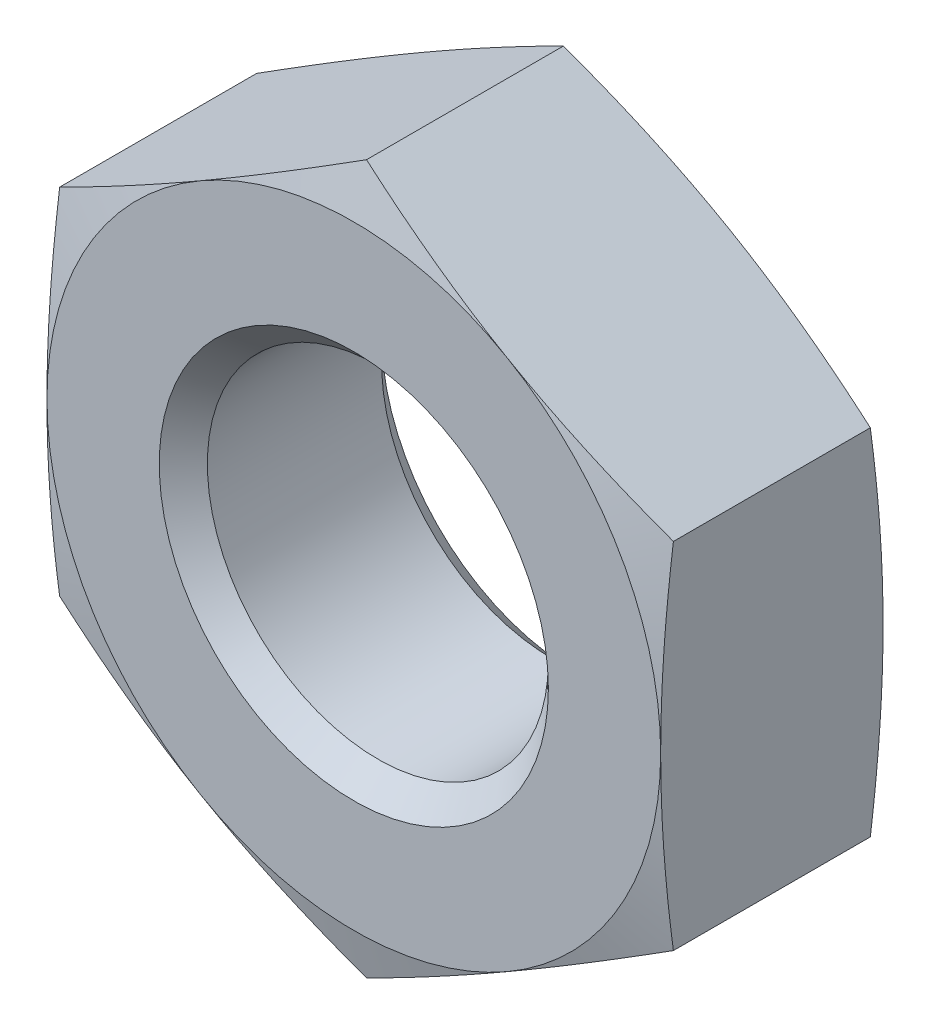
ISO-10303-21;
HEADER;
FILE_DESCRIPTION(('STEP AP214'),'2;1');
FILE_NAME('part.step','',(''),(''),'','','');
FILE_SCHEMA(('AUTOMOTIVE_DESIGN { 1 0 10303 214 1 1 1 1 }'));
ENDSEC;
DATA;
#1=APPLICATION_CONTEXT('core data for automotive mechanical design processes');
#2=APPLICATION_PROTOCOL_DEFINITION('international standard','automotive_design',2000,#1);
#3=PRODUCT_CONTEXT('',#1,'mechanical');
#4=PRODUCT('Part','Part','',(#3));
#5=PRODUCT_RELATED_PRODUCT_CATEGORY('part','',(#4));
#6=PRODUCT_DEFINITION_FORMATION('','',#4);
#7=PRODUCT_DEFINITION_CONTEXT('part definition',#1,'design');
#8=PRODUCT_DEFINITION('design','',#6,#7);
#9=PRODUCT_DEFINITION_SHAPE('','',#8);
#10=(LENGTH_UNIT() NAMED_UNIT(*) SI_UNIT(.MILLI.,.METRE.));
#11=(NAMED_UNIT(*) PLANE_ANGLE_UNIT() SI_UNIT($,.RADIAN.));
#12=(NAMED_UNIT(*) SI_UNIT($,.STERADIAN.) SOLID_ANGLE_UNIT());
#13=UNCERTAINTY_MEASURE_WITH_UNIT(LENGTH_MEASURE(1.E-05),#10,'distance_accuracy_value','');
#14=(GEOMETRIC_REPRESENTATION_CONTEXT(3) GLOBAL_UNCERTAINTY_ASSIGNED_CONTEXT((#13)) GLOBAL_UNIT_ASSIGNED_CONTEXT((#10,
#11,#12)) REPRESENTATION_CONTEXT('',''));
#15=CARTESIAN_POINT('',(0.,0.,0.));
#16=DIRECTION('',(0.,0.,1.));
#17=DIRECTION('',(1.,0.,0.));
#18=AXIS2_PLACEMENT_3D('',#15,#16,#17);
#19=CARTESIAN_POINT('',(0.,0.,0.));
#20=DIRECTION('',(0.,0.,-1.));
#21=DIRECTION('',(-1.,0.,0.));
#22=AXIS2_PLACEMENT_3D('',#19,#20,#21);
#23=PLANE('',#22);
#24=CARTESIAN_POINT('',(0.,0.,0.));
#25=DIRECTION('',(0.,0.,1.));
#26=DIRECTION('',(1.,0.,0.));
#27=AXIS2_PLACEMENT_3D('',#24,#25,#26);
#28=CIRCLE('',#27,8.763);
#29=CARTESIAN_POINT('',(8.763,0.,0.));
#30=VERTEX_POINT('',#29);
#31=CARTESIAN_POINT('',(4.38149999999967,7.58898061336304,0.));
#32=VERTEX_POINT('',#31);
#33=EDGE_CURVE('E11',#30,#32,#28,.T.);
#34=ORIENTED_EDGE('',*,*,#33,.T.);
#35=CARTESIAN_POINT('',(-4.38149999999967,7.58898061336304,0.));
#36=VERTEX_POINT('',#35);
#37=EDGE_CURVE('E47',#32,#36,#28,.T.);
#38=ORIENTED_EDGE('',*,*,#37,.T.);
#39=CARTESIAN_POINT('',(-8.763,0.,0.));
#40=VERTEX_POINT('',#39);
#41=EDGE_CURVE('E332',#36,#40,#28,.T.);
#42=ORIENTED_EDGE('',*,*,#41,.T.);
#43=CARTESIAN_POINT('',(-4.38149999999967,-7.58898061336304,0.));
#44=VERTEX_POINT('',#43);
#45=EDGE_CURVE('E325',#40,#44,#28,.T.);
#46=ORIENTED_EDGE('',*,*,#45,.T.);
#47=CARTESIAN_POINT('',(4.38149999999967,-7.58898061336304,0.));
#48=VERTEX_POINT('',#47);
#49=EDGE_CURVE('E328',#44,#48,#28,.T.);
#50=ORIENTED_EDGE('',*,*,#49,.T.);
#51=EDGE_CURVE('E48',#48,#30,#28,.T.);
#52=ORIENTED_EDGE('',*,*,#51,.T.);
#53=EDGE_LOOP('',(#34,#38,#42,#46,#50,#52));
#54=FACE_BOUND('',#53,.T.);
#55=CARTESIAN_POINT('',(0.,0.,0.));
#56=DIRECTION('',(0.,0.,1.));
#57=DIRECTION('',(1.,0.,0.));
#58=AXIS2_PLACEMENT_3D('',#55,#56,#57);
#59=CIRCLE('',#58,5.55625);
#60=CARTESIAN_POINT('',(5.55625,0.,0.));
#61=VERTEX_POINT('',#60);
#62=EDGE_CURVE('E189',#61,#61,#59,.T.);
#63=ORIENTED_EDGE('',*,*,#62,.F.);
#64=EDGE_LOOP('',(#63));
#65=FACE_BOUND('',#64,.T.);
#66=ADVANCED_FACE('F40',(#54,#65),#23,.F.);
#67=CARTESIAN_POINT('',(0.,8.763,-6.35));
#68=DIRECTION('',(0.,0.,1.));
#69=DIRECTION('',(1.,0.,0.));
#70=AXIS2_PLACEMENT_3D('',#67,#68,#69);
#71=PLANE('',#70);
#72=CARTESIAN_POINT('',(0.,0.,-6.35));
#73=DIRECTION('',(0.,0.,1.));
#74=DIRECTION('',(1.,0.,0.));
#75=AXIS2_PLACEMENT_3D('',#72,#73,#74);
#76=CIRCLE('',#75,8.763);
#77=CARTESIAN_POINT('',(8.763,0.,-6.35));
#78=VERTEX_POINT('',#77);
#79=CARTESIAN_POINT('',(4.38149999999967,7.58898061336304,-6.35));
#80=VERTEX_POINT('',#79);
#81=EDGE_CURVE('E363',#78,#80,#76,.T.);
#82=ORIENTED_EDGE('',*,*,#81,.F.);
#83=CARTESIAN_POINT('',(4.38149999999967,-7.58898061336305,-6.35));
#84=VERTEX_POINT('',#83);
#85=EDGE_CURVE('E366',#84,#78,#76,.T.);
#86=ORIENTED_EDGE('',*,*,#85,.F.);
#87=CARTESIAN_POINT('',(-4.38149999999967,-7.58898061336304,-6.35));
#88=VERTEX_POINT('',#87);
#89=EDGE_CURVE('E367',#88,#84,#76,.T.);
#90=ORIENTED_EDGE('',*,*,#89,.F.);
#91=CARTESIAN_POINT('',(-8.763,0.,-6.35));
#92=VERTEX_POINT('',#91);
#93=EDGE_CURVE('E147',#92,#88,#76,.T.);
#94=ORIENTED_EDGE('',*,*,#93,.F.);
#95=CARTESIAN_POINT('',(-4.38149999999967,7.58898061336304,-6.35));
#96=VERTEX_POINT('',#95);
#97=EDGE_CURVE('E364',#96,#92,#76,.T.);
#98=ORIENTED_EDGE('',*,*,#97,.F.);
#99=EDGE_CURVE('E360',#80,#96,#76,.T.);
#100=ORIENTED_EDGE('',*,*,#99,.F.);
#101=EDGE_LOOP('',(#82,#86,#90,#94,#98,#100));
#102=FACE_BOUND('',#101,.T.);
#103=CARTESIAN_POINT('',(0.,0.,-6.35));
#104=DIRECTION('',(0.,0.,1.));
#105=DIRECTION('',(1.,0.,0.));
#106=AXIS2_PLACEMENT_3D('',#103,#104,#105);
#107=CIRCLE('',#106,5.55625);
#108=CARTESIAN_POINT('',(5.55625,0.,-6.35));
#109=VERTEX_POINT('',#108);
#110=EDGE_CURVE('E209',#109,#109,#107,.T.);
#111=ORIENTED_EDGE('',*,*,#110,.T.);
#112=EDGE_LOOP('',(#111));
#113=FACE_BOUND('',#112,.T.);
#114=ADVANCED_FACE('F213',(#102,#113),#71,.F.);
#115=CARTESIAN_POINT('',(0.,0.,-0.46960775465478));
#116=DIRECTION('',(0.,0.,-1.));
#117=DIRECTION('',(-1.,0.,0.));
#118=AXIS2_PLACEMENT_3D('',#115,#116,#117);
#119=CONICAL_SURFACE('',#118,10.5156,1.30899693899575);
#120=CARTESIAN_POINT('',(-8.7632,5.05920493885486,-0.363273802998116));
#121=CARTESIAN_POINT('',(-8.39927804013863,5.26931538034483,-0.306951649740704));
#122=CARTESIAN_POINT('',(-8.03469625615076,5.47980677147184,-0.255820462401241));
#123=CARTESIAN_POINT('',(-7.30424516280663,5.9015329068439,-0.165987801407446));
#124=CARTESIAN_POINT('',(-6.93837539131905,6.11276791790058,-0.127291376259239));
#125=CARTESIAN_POINT('',(-6.20756655109666,6.5347005985291,-0.064587273673554));
#126=CARTESIAN_POINT('',(-5.84263242389508,6.7453954151054,-0.0405048202732606));
#127=CARTESIAN_POINT('',(-5.11229879530945,7.16705373216752,-0.00821271888191033));
#128=CARTESIAN_POINT('',(-4.74689939765473,7.37801717276519,0.));
#129=CARTESIAN_POINT('',(-4.01610060234528,7.79994405396051,0.));
#130=CARTESIAN_POINT('',(-3.65070120469056,8.01090749455818,-0.00821271888188964));
#131=CARTESIAN_POINT('',(-2.92036757610492,8.4325658116203,-0.0405048202732208));
#132=CARTESIAN_POINT('',(-2.55543344890334,8.64326062819659,-0.0645872736735054));
#133=CARTESIAN_POINT('',(-1.82462460868095,9.06519330882512,-0.127291376259173));
#134=CARTESIAN_POINT('',(-1.45875483719337,9.2764283198818,-0.165987801407371));
#135=CARTESIAN_POINT('',(-0.728303743849241,9.69815445525386,-0.255820462401151));
#136=CARTESIAN_POINT('',(-0.363721959861376,9.90864584638088,-0.306951649740607));
#137=CARTESIAN_POINT('',(0.000200000000000257,10.1187562878708,-0.363273802998012));
#138=B_SPLINE_CURVE_WITH_KNOTS('',3,(#120,#121,#122,#123,#124,#125,#126,#127,#128,#129,#130,
#131,#132,#133,#134,#135,#136,#137),.UNSPECIFIED.,.F.,.F.,(4,2,2,2,2,2,2,2,4),(0.,
1.27200216485818,2.5445201112656,3.81047076613488,5.07617642725257,6.34188208837027,
7.60783274323955,8.88035068964697,10.1523528545052),.UNSPECIFIED.);
#139=CARTESIAN_POINT('',(-8.763,5.0593204089087,-0.363242862360831));
#140=VERTEX_POINT('',#139);
#141=EDGE_CURVE('E340',#140,#36,#138,.T.);
#142=ORIENTED_EDGE('',*,*,#141,.F.);
#143=CARTESIAN_POINT('',(-8.763,-13.3837702899199,-1.93844049434777));
#144=CARTESIAN_POINT('',(-8.763,-12.9862181649756,-1.84934412146664));
#145=CARTESIAN_POINT('',(-8.763,-12.5884173836727,-1.76133740130551));
#146=CARTESIAN_POINT('',(-8.763,-11.792196389762,-1.58809143425452));
#147=CARTESIAN_POINT('',(-8.763,-11.3937761511781,-1.50285230688892));
#148=CARTESIAN_POINT('',(-8.763,-10.5958372220428,-1.33565551527808));
#149=CARTESIAN_POINT('',(-8.763,-10.1963178373504,-1.2537011520015));
#150=CARTESIAN_POINT('',(-8.763,-9.39644750668763,-1.09395849709296));
#151=CARTESIAN_POINT('',(-8.763,-8.99609656776501,-1.0161701703002));
#152=CARTESIAN_POINT('',(-8.763,-8.19761138133054,-0.866351145193688));
#153=CARTESIAN_POINT('',(-8.763,-7.7994848436043,-0.794279558247119));
#154=CARTESIAN_POINT('',(-8.763,-7.00214580050872,-0.656428589692995));
#155=CARTESIAN_POINT('',(-8.763,-6.60293331923369,-0.590649069632863));
#156=CARTESIAN_POINT('',(-8.763,-5.80334489207022,-0.466863323728334));
#157=CARTESIAN_POINT('',(-8.763,-5.40296909562369,-0.408856140943656));
#158=CARTESIAN_POINT('',(-8.763,-4.60094342795015,-0.302324446329907));
#159=CARTESIAN_POINT('',(-8.763,-4.19929355552988,-0.253799943384739));
#160=CARTESIAN_POINT('',(-8.763,-3.39018837962683,-0.167607648360078));
#161=CARTESIAN_POINT('',(-8.763,-2.98271903379171,-0.130069718559839));
#162=CARTESIAN_POINT('',(-8.763,-2.16675595793937,-0.0684401455251191));
#163=CARTESIAN_POINT('',(-8.763,-1.75826225163068,-0.0443481939203276));
#164=CARTESIAN_POINT('',(-8.763,-0.940843012454314,-0.0110157171231371));
#165=CARTESIAN_POINT('',(-8.763,-0.531917760453649,-0.00176844288722009));
#166=CARTESIAN_POINT('',(-8.763,0.285991550994262,0.00130613861734006));
#167=CARTESIAN_POINT('',(-8.763,0.694975610390509,-0.00486654082138649));
#168=CARTESIAN_POINT('',(-8.763,1.51391612064036,-0.0322847373045139));
#169=CARTESIAN_POINT('',(-8.763,1.92387070253099,-0.0535849596048437));
#170=CARTESIAN_POINT('',(-8.763,2.74281574927551,-0.110042389929746));
#171=CARTESIAN_POINT('',(-8.763,3.15180619258268,-0.145199904740592));
#172=CARTESIAN_POINT('',(-8.763,3.96881951949812,-0.22759601433524));
#173=CARTESIAN_POINT('',(-8.763,4.37684159561712,-0.27484249329322));
#174=CARTESIAN_POINT('',(-8.763,5.19157263502939,-0.379450538965934));
#175=CARTESIAN_POINT('',(-8.763,5.59828159419586,-0.436812137438485));
#176=CARTESIAN_POINT('',(-8.763,6.38354017699799,-0.555743213369239));
#177=CARTESIAN_POINT('',(-8.763,6.76217092727843,-0.616782449788006));
#178=CARTESIAN_POINT('',(-8.763,7.51843456139871,-0.744785447310177));
#179=CARTESIAN_POINT('',(-8.763,7.89606741772422,-0.81174937005183));
#180=CARTESIAN_POINT('',(-8.763,8.65047296826483,-0.950519483254617));
#181=CARTESIAN_POINT('',(-8.763,9.02724558226135,-1.02232610765112));
#182=CARTESIAN_POINT('',(-8.763,9.78001835031701,-1.16989133180626));
#183=CARTESIAN_POINT('',(-8.763,10.1560184943023,-1.24564998276803));
#184=CARTESIAN_POINT('',(-8.763,10.9074351141636,-1.40042140295396));
#185=CARTESIAN_POINT('',(-8.763,11.2828514390693,-1.47943490312786));
#186=CARTESIAN_POINT('',(-8.763,12.0331126862545,-1.64013356208892));
#187=CARTESIAN_POINT('',(-8.763,12.4079576051979,-1.72181873641227));
#188=CARTESIAN_POINT('',(-8.763,13.5317125358089,-1.97016081007156));
#189=CARTESIAN_POINT('',(-8.763,14.279893613434,-2.14011488200832));
#190=CARTESIAN_POINT('',(-8.763,15.7674818810842,-2.48445565533592));
#191=CARTESIAN_POINT('',(-8.763,16.5069030435853,-2.65878238911854));
#192=CARTESIAN_POINT('',(-8.763,17.9847143075208,-3.01180428588832));
#193=CARTESIAN_POINT('',(-8.763,18.7231043899121,-3.19049952845809));
#194=CARTESIAN_POINT('',(-8.763,20.1981842908095,-3.5508912153922));
#195=CARTESIAN_POINT('',(-8.763,20.9348750830499,-3.73258368406784));
#196=CARTESIAN_POINT('',(-8.763,22.4076149635126,-4.09844959544106));
#197=CARTESIAN_POINT('',(-8.763,23.1436640721096,-4.2826229560661));
#198=CARTESIAN_POINT('',(-8.763,23.8794895947639,-4.46767540457424));
#199=B_SPLINE_CURVE_WITH_KNOTS('',3,(#143,#144,#145,#146,#147,#148,#149,#150,#151,#152,#153,
#154,#155,#156,#157,#158,#159,#160,#161,#162,#163,#164,#165,#166,#167,#168,#169,#170,#171,#172,
#173,#174,#175,#176,#177,#178,#179,#180,#181,#182,#183,#184,#185,#186,#187,#188,#189,#190,#191,
#192,#193,#194,#195,#196,#197,#198),.UNSPECIFIED.,.F.,.F.,(4,2,2,2,2,2,2,2,2,2,2,2,2,2,2,2,2,2,
2,2,2,2,2,2,2,2,2,4),(0.,1.22224582683769,2.44454436889226,3.66804192292283,4.89152914916844,
6.10528101679588,7.31900617050677,8.53258175121245,9.74615846885785,10.9735486088279,
12.2009105986532,13.4277144175138,14.6545171788198,15.8857791275233,17.1170683366373,
18.3491626232361,19.5812607782343,20.7317631716272,21.8822969628969,23.0329339862866,
24.183585921232,25.3344976849745,26.4854161426325,28.7870971026554,31.0661607154404,
33.345265877679,35.6215585602892,37.8977761229223),.UNSPECIFIED.);
#200=EDGE_CURVE('E158',#40,#140,#199,.T.);
#201=ORIENTED_EDGE('',*,*,#200,.F.);
#202=ORIENTED_EDGE('',*,*,#41,.F.);
#203=EDGE_LOOP('',(#142,#201,#202));
#204=FACE_BOUND('',#203,.T.);
#205=ADVANCED_FACE('F231',(#204),#119,.T.);
#206=CARTESIAN_POINT('',(0.,10.118640817817,-0.363242862360728));
#207=VERTEX_POINT('',#206);
#208=EDGE_CURVE('E337',#36,#207,#138,.T.);
#209=ORIENTED_EDGE('',*,*,#208,.F.);
#210=ORIENTED_EDGE('',*,*,#37,.F.);
#211=CARTESIAN_POINT('',(-0.0002,10.1187562878708,-0.363273802998012));
#212=CARTESIAN_POINT('',(0.363721959861376,9.90864584638087,-0.306951649740606));
#213=CARTESIAN_POINT('',(0.728303743849241,9.69815445525386,-0.25582046240115));
#214=CARTESIAN_POINT('',(1.45875483719337,9.2764283198818,-0.165987801407371));
#215=CARTESIAN_POINT('',(1.82462460868095,9.06519330882512,-0.127291376259173));
#216=CARTESIAN_POINT('',(2.55543344890334,8.64326062819659,-0.0645872736735056));
#217=CARTESIAN_POINT('',(2.92036757610492,8.4325658116203,-0.0405048202732212));
#218=CARTESIAN_POINT('',(3.65070120469056,8.01090749455818,-0.00821271888188998));
#219=CARTESIAN_POINT('',(4.01610060234528,7.79994405396051,0.));
#220=CARTESIAN_POINT('',(4.74689939765473,7.37801717276518,0.));
#221=CARTESIAN_POINT('',(5.11229879530945,7.16705373216752,-0.00821271888190999));
#222=CARTESIAN_POINT('',(5.84263242389508,6.7453954151054,-0.0405048202732604));
#223=CARTESIAN_POINT('',(6.20756655109666,6.5347005985291,-0.064587273673554));
#224=CARTESIAN_POINT('',(6.93837539131905,6.11276791790058,-0.127291376259239));
#225=CARTESIAN_POINT('',(7.30424516280663,5.9015329068439,-0.165987801407446));
#226=CARTESIAN_POINT('',(8.03469625615076,5.47980677147184,-0.255820462401241));
#227=CARTESIAN_POINT('',(8.39927804013863,5.26931538034483,-0.306951649740704));
#228=CARTESIAN_POINT('',(8.7632,5.05920493885486,-0.363273802998116));
#229=B_SPLINE_CURVE_WITH_KNOTS('',3,(#211,#212,#213,#214,#215,#216,#217,#218,#219,#220,#221,
#222,#223,#224,#225,#226,#227,#228),.UNSPECIFIED.,.F.,.F.,(4,2,2,2,2,2,2,2,4),(0.,
1.27200216485818,2.5445201112656,3.81047076613488,5.07617642725258,6.34188208837027,
7.60783274323955,8.88035068964697,10.1523528545052),.UNSPECIFIED.);
#230=EDGE_CURVE('E270',#207,#32,#229,.T.);
#231=ORIENTED_EDGE('',*,*,#230,.F.);
#232=EDGE_LOOP('',(#209,#210,#231));
#233=FACE_BOUND('',#232,.T.);
#234=ADVANCED_FACE('F279',(#233),#119,.T.);
#235=CARTESIAN_POINT('',(8.763,5.0593204089087,-0.363242862360831));
#236=VERTEX_POINT('',#235);
#237=EDGE_CURVE('E265',#32,#236,#229,.T.);
#238=ORIENTED_EDGE('',*,*,#237,.F.);
#239=ORIENTED_EDGE('',*,*,#33,.F.);
#240=CARTESIAN_POINT('',(8.763,-13.3837702899199,-1.93844049434777));
#241=CARTESIAN_POINT('',(8.763,-12.9862181649756,-1.84934412146664));
#242=CARTESIAN_POINT('',(8.763,-12.5884173836727,-1.76133740130551));
#243=CARTESIAN_POINT('',(8.763,-11.792196389762,-1.58809143425452));
#244=CARTESIAN_POINT('',(8.763,-11.3937761511781,-1.50285230688892));
#245=CARTESIAN_POINT('',(8.763,-10.5958372220428,-1.33565551527808));
#246=CARTESIAN_POINT('',(8.763,-10.1963178373504,-1.2537011520015));
#247=CARTESIAN_POINT('',(8.763,-9.39644750668763,-1.09395849709296));
#248=CARTESIAN_POINT('',(8.763,-8.99609656776501,-1.0161701703002));
#249=CARTESIAN_POINT('',(8.763,-8.19761138133054,-0.866351145193688));
#250=CARTESIAN_POINT('',(8.763,-7.7994848436043,-0.794279558247119));
#251=CARTESIAN_POINT('',(8.763,-7.00214580050872,-0.656428589692995));
#252=CARTESIAN_POINT('',(8.763,-6.60293331923369,-0.590649069632863));
#253=CARTESIAN_POINT('',(8.763,-5.80334489207022,-0.466863323728334));
#254=CARTESIAN_POINT('',(8.763,-5.40296909562369,-0.408856140943656));
#255=CARTESIAN_POINT('',(8.763,-4.60094342795015,-0.302324446329907));
#256=CARTESIAN_POINT('',(8.763,-4.19929355552988,-0.253799943384739));
#257=CARTESIAN_POINT('',(8.763,-3.39018837962683,-0.167607648360078));
#258=CARTESIAN_POINT('',(8.763,-2.98271903379171,-0.130069718559839));
#259=CARTESIAN_POINT('',(8.763,-2.16675595793937,-0.0684401455251191));
#260=CARTESIAN_POINT('',(8.763,-1.75826225163068,-0.0443481939203276));
#261=CARTESIAN_POINT('',(8.763,-0.940843012454314,-0.0110157171231371));
#262=CARTESIAN_POINT('',(8.763,-0.531917760453649,-0.00176844288722009));
#263=CARTESIAN_POINT('',(8.763,0.285991550994262,0.00130613861734006));
#264=CARTESIAN_POINT('',(8.763,0.694975610390509,-0.00486654082138649));
#265=CARTESIAN_POINT('',(8.763,1.51391612064036,-0.0322847373045139));
#266=CARTESIAN_POINT('',(8.763,1.92387070253099,-0.0535849596048437));
#267=CARTESIAN_POINT('',(8.763,2.74281574927551,-0.110042389929746));
#268=CARTESIAN_POINT('',(8.763,3.15180619258268,-0.145199904740592));
#269=CARTESIAN_POINT('',(8.763,3.96881951949812,-0.22759601433524));
#270=CARTESIAN_POINT('',(8.763,4.37684159561712,-0.27484249329322));
#271=CARTESIAN_POINT('',(8.763,5.19157263502939,-0.379450538965934));
#272=CARTESIAN_POINT('',(8.763,5.59828159419586,-0.436812137438485));
#273=CARTESIAN_POINT('',(8.763,6.38354017699799,-0.555743213369239));
#274=CARTESIAN_POINT('',(8.763,6.76217092727843,-0.616782449788006));
#275=CARTESIAN_POINT('',(8.763,7.51843456139871,-0.744785447310177));
#276=CARTESIAN_POINT('',(8.763,7.89606741772422,-0.81174937005183));
#277=CARTESIAN_POINT('',(8.763,8.65047296826483,-0.950519483254617));
#278=CARTESIAN_POINT('',(8.763,9.02724558226135,-1.02232610765112));
#279=CARTESIAN_POINT('',(8.763,9.78001835031701,-1.16989133180626));
#280=CARTESIAN_POINT('',(8.763,10.1560184943023,-1.24564998276803));
#281=CARTESIAN_POINT('',(8.763,10.9074351141636,-1.40042140295396));
#282=CARTESIAN_POINT('',(8.763,11.2828514390693,-1.47943490312786));
#283=CARTESIAN_POINT('',(8.763,12.0331126862545,-1.64013356208892));
#284=CARTESIAN_POINT('',(8.763,12.4079576051979,-1.72181873641227));
#285=CARTESIAN_POINT('',(8.763,13.5317125358089,-1.97016081007156));
#286=CARTESIAN_POINT('',(8.763,14.279893613434,-2.14011488200832));
#287=CARTESIAN_POINT('',(8.763,15.7674818810842,-2.48445565533592));
#288=CARTESIAN_POINT('',(8.763,16.5069030435853,-2.65878238911854));
#289=CARTESIAN_POINT('',(8.763,17.9847143075208,-3.01180428588832));
#290=CARTESIAN_POINT('',(8.763,18.7231043899121,-3.19049952845809));
#291=CARTESIAN_POINT('',(8.763,20.1981842908095,-3.5508912153922));
#292=CARTESIAN_POINT('',(8.763,20.9348750830499,-3.73258368406784));
#293=CARTESIAN_POINT('',(8.763,22.4076149635126,-4.09844959544106));
#294=CARTESIAN_POINT('',(8.763,23.1436640721096,-4.2826229560661));
#295=CARTESIAN_POINT('',(8.763,23.8794895947639,-4.46767540457424));
#296=B_SPLINE_CURVE_WITH_KNOTS('',3,(#240,#241,#242,#243,#244,#245,#246,#247,#248,#249,#250,
#251,#252,#253,#254,#255,#256,#257,#258,#259,#260,#261,#262,#263,#264,#265,#266,#267,#268,#269,
#270,#271,#272,#273,#274,#275,#276,#277,#278,#279,#280,#281,#282,#283,#284,#285,#286,#287,#288,
#289,#290,#291,#292,#293,#294,#295),.UNSPECIFIED.,.F.,.F.,(4,2,2,2,2,2,2,2,2,2,2,2,2,2,2,2,2,2,
2,2,2,2,2,2,2,2,2,4),(0.,1.22224582683769,2.44454436889226,3.66804192292283,4.89152914916844,
6.10528101679588,7.31900617050677,8.53258175121245,9.74615846885785,10.9735486088279,
12.2009105986532,13.4277144175138,14.6545171788198,15.8857791275233,17.1170683366373,
18.3491626232361,19.5812607782343,20.7317631716272,21.8822969628969,23.0329339862866,
24.183585921232,25.3344976849745,26.4854161426325,28.7870971026554,31.0661607154404,
33.345265877679,35.6215585602892,37.8977761229223),.UNSPECIFIED.);
#297=EDGE_CURVE('E297',#236,#30,#296,.F.);
#298=ORIENTED_EDGE('',*,*,#297,.F.);
#299=EDGE_LOOP('',(#238,#239,#298));
#300=FACE_BOUND('',#299,.T.);
#301=ADVANCED_FACE('F351',(#300),#119,.T.);
#302=CARTESIAN_POINT('',(8.763,-5.0593204089087,-0.363242862360831));
#303=VERTEX_POINT('',#302);
#304=EDGE_CURVE('E293',#30,#303,#296,.F.);
#305=ORIENTED_EDGE('',*,*,#304,.F.);
#306=ORIENTED_EDGE('',*,*,#51,.F.);
#307=CARTESIAN_POINT('',(8.7632,-5.05920493885486,-0.363273802998116));
#308=CARTESIAN_POINT('',(8.39927804013863,-5.26931538034483,-0.306951649740704));
#309=CARTESIAN_POINT('',(8.03469625615076,-5.47980677147184,-0.255820462401241));
#310=CARTESIAN_POINT('',(7.30424516280663,-5.9015329068439,-0.165987801407446));
#311=CARTESIAN_POINT('',(6.93837539131905,-6.11276791790058,-0.127291376259239));
#312=CARTESIAN_POINT('',(6.20756655109666,-6.5347005985291,-0.064587273673554));
#313=CARTESIAN_POINT('',(5.84263242389508,-6.7453954151054,-0.0405048202732606));
#314=CARTESIAN_POINT('',(5.11229879530945,-7.16705373216752,-0.00821271888191033));
#315=CARTESIAN_POINT('',(4.74689939765473,-7.37801717276519,0.));
#316=CARTESIAN_POINT('',(4.01610060234528,-7.79994405396051,0.));
#317=CARTESIAN_POINT('',(3.65070120469056,-8.01090749455818,-0.00821271888188964));
#318=CARTESIAN_POINT('',(2.92036757610492,-8.4325658116203,-0.0405048202732208));
#319=CARTESIAN_POINT('',(2.55543344890334,-8.64326062819659,-0.0645872736735054));
#320=CARTESIAN_POINT('',(1.82462460868095,-9.06519330882512,-0.127291376259173));
#321=CARTESIAN_POINT('',(1.45875483719337,-9.2764283198818,-0.165987801407371));
#322=CARTESIAN_POINT('',(0.728303743849241,-9.69815445525386,-0.255820462401151));
#323=CARTESIAN_POINT('',(0.363721959861376,-9.90864584638088,-0.306951649740607));
#324=CARTESIAN_POINT('',(-0.000200000000000257,-10.1187562878708,-0.363273802998012));
#325=B_SPLINE_CURVE_WITH_KNOTS('',3,(#307,#308,#309,#310,#311,#312,#313,#314,#315,#316,#317,
#318,#319,#320,#321,#322,#323,#324),.UNSPECIFIED.,.F.,.F.,(4,2,2,2,2,2,2,2,4),(0.,
1.27200216485818,2.5445201112656,3.81047076613488,5.07617642725257,6.34188208837027,
7.60783274323955,8.88035068964697,10.1523528545052),.UNSPECIFIED.);
#326=EDGE_CURVE('E303',#303,#48,#325,.T.);
#327=ORIENTED_EDGE('',*,*,#326,.F.);
#328=EDGE_LOOP('',(#305,#306,#327));
#329=FACE_BOUND('',#328,.T.);
#330=ADVANCED_FACE('F391',(#329),#119,.T.);
#331=CARTESIAN_POINT('',(0.,-10.118640817817,-0.363242862360728));
#332=VERTEX_POINT('',#331);
#333=EDGE_CURVE('E288',#48,#332,#325,.T.);
#334=ORIENTED_EDGE('',*,*,#333,.F.);
#335=ORIENTED_EDGE('',*,*,#49,.F.);
#336=CARTESIAN_POINT('',(0.0002,-10.1187562878708,-0.363273802998012));
#337=CARTESIAN_POINT('',(-0.363721959861376,-9.90864584638087,-0.306951649740606));
#338=CARTESIAN_POINT('',(-0.728303743849241,-9.69815445525386,-0.25582046240115));
#339=CARTESIAN_POINT('',(-1.45875483719337,-9.2764283198818,-0.165987801407371));
#340=CARTESIAN_POINT('',(-1.82462460868095,-9.06519330882512,-0.127291376259173));
#341=CARTESIAN_POINT('',(-2.55543344890334,-8.64326062819659,-0.0645872736735056));
#342=CARTESIAN_POINT('',(-2.92036757610492,-8.4325658116203,-0.0405048202732212));
#343=CARTESIAN_POINT('',(-3.65070120469056,-8.01090749455818,-0.00821271888188998));
#344=CARTESIAN_POINT('',(-4.01610060234528,-7.79994405396051,0.));
#345=CARTESIAN_POINT('',(-4.74689939765473,-7.37801717276518,0.));
#346=CARTESIAN_POINT('',(-5.11229879530945,-7.16705373216752,-0.00821271888190999));
#347=CARTESIAN_POINT('',(-5.84263242389508,-6.7453954151054,-0.0405048202732604));
#348=CARTESIAN_POINT('',(-6.20756655109666,-6.5347005985291,-0.064587273673554));
#349=CARTESIAN_POINT('',(-6.93837539131905,-6.11276791790058,-0.127291376259239));
#350=CARTESIAN_POINT('',(-7.30424516280663,-5.9015329068439,-0.165987801407446));
#351=CARTESIAN_POINT('',(-8.03469625615076,-5.47980677147184,-0.255820462401241));
#352=CARTESIAN_POINT('',(-8.39927804013863,-5.26931538034483,-0.306951649740704));
#353=CARTESIAN_POINT('',(-8.7632,-5.05920493885486,-0.363273802998116));
#354=B_SPLINE_CURVE_WITH_KNOTS('',3,(#336,#337,#338,#339,#340,#341,#342,#343,#344,#345,#346,
#347,#348,#349,#350,#351,#352,#353),.UNSPECIFIED.,.F.,.F.,(4,2,2,2,2,2,2,2,4),(0.,
1.27200216485818,2.5445201112656,3.81047076613488,5.07617642725258,6.34188208837027,
7.60783274323955,8.88035068964697,10.1523528545052),.UNSPECIFIED.);
#355=EDGE_CURVE('E150',#332,#44,#354,.T.);
#356=ORIENTED_EDGE('',*,*,#355,.F.);
#357=EDGE_LOOP('',(#334,#335,#356));
#358=FACE_BOUND('',#357,.T.);
#359=ADVANCED_FACE('F329',(#358),#119,.T.);
#360=CARTESIAN_POINT('',(-8.763,-5.0593204089087,-0.363242862360831));
#361=VERTEX_POINT('',#360);
#362=EDGE_CURVE('E142',#44,#361,#354,.T.);
#363=ORIENTED_EDGE('',*,*,#362,.F.);
#364=ORIENTED_EDGE('',*,*,#45,.F.);
#365=EDGE_CURVE('E55',#361,#40,#199,.T.);
#366=ORIENTED_EDGE('',*,*,#365,.F.);
#367=EDGE_LOOP('',(#363,#364,#366));
#368=FACE_BOUND('',#367,.T.);
#369=ADVANCED_FACE('F281',(#368),#119,.T.);
#370=CARTESIAN_POINT('',(0.,10.118640817817,-6.35));
#371=DIRECTION('',(-0.499999999999971,0.866025403784455,0.));
#372=DIRECTION('',(-0.866025403784455,-0.499999999999971,0.));
#373=AXIS2_PLACEMENT_3D('',#370,#371,#372);
#374=PLANE('',#373);
#375=ORIENTED_EDGE('',*,*,#141,.T.);
#376=ORIENTED_EDGE('',*,*,#208,.T.);
#377=DIRECTION('',(0.,0.,1.));
#378=VECTOR('',#377,1.);
#379=CARTESIAN_POINT('',(0.,10.118640817817,-6.35));
#380=LINE('',#379,#378);
#381=CARTESIAN_POINT('',(0.,10.118640817817,-5.98675713763926));
#382=VERTEX_POINT('',#381);
#383=EDGE_CURVE('E135',#382,#207,#380,.T.);
#384=ORIENTED_EDGE('',*,*,#383,.F.);
#385=CARTESIAN_POINT('',(0.000200000000000106,10.1187562878708,-5.98672619700197));
#386=CARTESIAN_POINT('',(-0.363721959861376,9.90864584638088,-6.04304835025938));
#387=CARTESIAN_POINT('',(-0.728303743849241,9.69815445525386,-6.09417953759884));
#388=CARTESIAN_POINT('',(-1.45875483719337,9.2764283198818,-6.18401219859262));
#389=CARTESIAN_POINT('',(-1.82462460868095,9.06519330882512,-6.22270862374082));
#390=CARTESIAN_POINT('',(-2.55543344890334,8.64326062819659,-6.28541272632649));
#391=CARTESIAN_POINT('',(-2.92036757610492,8.4325658116203,-6.30949517972678));
#392=CARTESIAN_POINT('',(-3.65070120469056,8.01090749455818,-6.34178728111811));
#393=CARTESIAN_POINT('',(-4.01610060234528,7.79994405396051,-6.35000000000005));
#394=CARTESIAN_POINT('',(-4.74689939765473,7.37801717276519,-6.35000000000004));
#395=CARTESIAN_POINT('',(-5.11229879530945,7.16705373216752,-6.34178728111809));
#396=CARTESIAN_POINT('',(-5.84263242389508,6.7453954151054,-6.30949517972674));
#397=CARTESIAN_POINT('',(-6.20756655109666,6.5347005985291,-6.28541272632644));
#398=CARTESIAN_POINT('',(-6.93837539131905,6.11276791790058,-6.22270862374075));
#399=CARTESIAN_POINT('',(-7.30424516280663,5.9015329068439,-6.18401219859255));
#400=CARTESIAN_POINT('',(-8.03469625615076,5.47980677147184,-6.09417953759875));
#401=CARTESIAN_POINT('',(-8.39927804013863,5.26931538034483,-6.04304835025928));
#402=CARTESIAN_POINT('',(-8.7632,5.05920493885486,-5.98672619700187));
#403=B_SPLINE_CURVE_WITH_KNOTS('',3,(#385,#386,#387,#388,#389,#390,#391,#392,#393,#394,#395,
#396,#397,#398,#399,#400,#401,#402),.UNSPECIFIED.,.F.,.F.,(4,2,2,2,2,2,2,2,4),(0.,
1.27200216485818,2.5445201112656,3.81047076613488,5.07617642725258,6.34188208837027,
7.60783274323955,8.88035068964697,10.1523528545052),.UNSPECIFIED.);
#404=EDGE_CURVE('E341',#382,#96,#403,.T.);
#405=ORIENTED_EDGE('',*,*,#404,.T.);
#406=CARTESIAN_POINT('',(-8.763,5.0593204089087,-5.98675713763915));
#407=VERTEX_POINT('',#406);
#408=EDGE_CURVE('E272',#96,#407,#403,.T.);
#409=ORIENTED_EDGE('',*,*,#408,.T.);
#410=DIRECTION('',(0.,0.,1.));
#411=VECTOR('',#410,1.);
#412=CARTESIAN_POINT('',(-8.763,5.0593204089087,-6.35));
#413=LINE('',#412,#411);
#414=EDGE_CURVE('E144',#407,#140,#413,.T.);
#415=ORIENTED_EDGE('',*,*,#414,.T.);
#416=EDGE_LOOP('',(#375,#376,#384,#405,#409,#415));
#417=FACE_BOUND('',#416,.T.);
#418=ADVANCED_FACE('F181',(#417),#374,.T.);
#419=CARTESIAN_POINT('',(8.763,5.0593204089087,-6.35));
#420=DIRECTION('',(0.499999999999971,0.866025403784455,0.));
#421=DIRECTION('',(-0.866025403784455,0.499999999999971,0.));
#422=AXIS2_PLACEMENT_3D('',#419,#420,#421);
#423=PLANE('',#422);
#424=ORIENTED_EDGE('',*,*,#230,.T.);
#425=ORIENTED_EDGE('',*,*,#237,.T.);
#426=DIRECTION('',(0.,0.,1.));
#427=VECTOR('',#426,1.);
#428=CARTESIAN_POINT('',(8.763,5.0593204089087,-6.35));
#429=LINE('',#428,#427);
#430=CARTESIAN_POINT('',(8.763,5.0593204089087,-5.98675713763915));
#431=VERTEX_POINT('',#430);
#432=EDGE_CURVE('E196',#431,#236,#429,.T.);
#433=ORIENTED_EDGE('',*,*,#432,.F.);
#434=CARTESIAN_POINT('',(8.7632,5.05920493885486,-5.98672619700187));
#435=CARTESIAN_POINT('',(8.39927804013863,5.26931538034483,-6.04304835025928));
#436=CARTESIAN_POINT('',(8.03469625615076,5.47980677147184,-6.09417953759875));
#437=CARTESIAN_POINT('',(7.30424516280663,5.9015329068439,-6.18401219859255));
#438=CARTESIAN_POINT('',(6.93837539131905,6.11276791790058,-6.22270862374075));
#439=CARTESIAN_POINT('',(6.20756655109666,6.5347005985291,-6.28541272632644));
#440=CARTESIAN_POINT('',(5.84263242389508,6.7453954151054,-6.30949517972674));
#441=CARTESIAN_POINT('',(5.11229879530945,7.16705373216752,-6.34178728111809));
#442=CARTESIAN_POINT('',(4.74689939765473,7.37801717276518,-6.35000000000004));
#443=CARTESIAN_POINT('',(4.01610060234528,7.79994405396051,-6.35000000000005));
#444=CARTESIAN_POINT('',(3.65070120469056,8.01090749455818,-6.34178728111811));
#445=CARTESIAN_POINT('',(2.92036757610492,8.4325658116203,-6.30949517972678));
#446=CARTESIAN_POINT('',(2.55543344890334,8.64326062819659,-6.28541272632649));
#447=CARTESIAN_POINT('',(1.82462460868095,9.06519330882512,-6.22270862374082));
#448=CARTESIAN_POINT('',(1.45875483719337,9.2764283198818,-6.18401219859262));
#449=CARTESIAN_POINT('',(0.728303743849241,9.69815445525386,-6.09417953759884));
#450=CARTESIAN_POINT('',(0.363721959861375,9.90864584638088,-6.04304835025938));
#451=CARTESIAN_POINT('',(-0.000200000000000574,10.1187562878708,-5.98672619700197));
#452=B_SPLINE_CURVE_WITH_KNOTS('',3,(#434,#435,#436,#437,#438,#439,#440,#441,#442,#443,#444,
#445,#446,#447,#448,#449,#450,#451),.UNSPECIFIED.,.F.,.F.,(4,2,2,2,2,2,2,2,4),(0.,
1.27200216485818,2.5445201112656,3.81047076613488,5.07617642725258,6.34188208837027,
7.60783274323956,8.88035068964697,10.1523528545052),.UNSPECIFIED.);
#453=EDGE_CURVE('E271',#431,#80,#452,.T.);
#454=ORIENTED_EDGE('',*,*,#453,.T.);
#455=EDGE_CURVE('E259',#80,#382,#452,.T.);
#456=ORIENTED_EDGE('',*,*,#455,.T.);
#457=ORIENTED_EDGE('',*,*,#383,.T.);
#458=EDGE_LOOP('',(#424,#425,#433,#454,#456,#457));
#459=FACE_BOUND('',#458,.T.);
#460=ADVANCED_FACE('F251',(#459),#423,.T.);
#461=CARTESIAN_POINT('',(8.763,-5.0593204089087,-6.35));
#462=DIRECTION('',(1.,0.,0.));
#463=DIRECTION('',(0.,0.,-1.));
#464=AXIS2_PLACEMENT_3D('',#461,#462,#463);
#465=PLANE('',#464);
#466=ORIENTED_EDGE('',*,*,#297,.T.);
#467=ORIENTED_EDGE('',*,*,#304,.T.);
#468=DIRECTION('',(0.,0.,1.));
#469=VECTOR('',#468,1.);
#470=CARTESIAN_POINT('',(8.763,-5.0593204089087,-6.35));
#471=LINE('',#470,#469);
#472=CARTESIAN_POINT('',(8.763,-5.0593204089087,-5.98675713763915));
#473=VERTEX_POINT('',#472);
#474=EDGE_CURVE('E193',#473,#303,#471,.T.);
#475=ORIENTED_EDGE('',*,*,#474,.F.);
#476=CARTESIAN_POINT('',(8.763,-13.3837702899199,-4.41155950565215));
#477=CARTESIAN_POINT('',(8.763,-12.9862181649756,-4.50065587853328));
#478=CARTESIAN_POINT('',(8.763,-12.5884173836727,-4.58866259869441));
#479=CARTESIAN_POINT('',(8.763,-11.792196389762,-4.76190856574541));
#480=CARTESIAN_POINT('',(8.763,-11.3937761511781,-4.84714769311101));
#481=CARTESIAN_POINT('',(8.763,-10.5958372220428,-5.01434448472186));
#482=CARTESIAN_POINT('',(8.763,-10.1963178373504,-5.09629884799844));
#483=CARTESIAN_POINT('',(8.763,-9.39644750668763,-5.25604150290699));
#484=CARTESIAN_POINT('',(8.763,-8.99609656776501,-5.33382982969976));
#485=CARTESIAN_POINT('',(8.763,-8.19761138133054,-5.48364885480628));
#486=CARTESIAN_POINT('',(8.763,-7.7994848436043,-5.55572044175285));
#487=CARTESIAN_POINT('',(8.763,-7.00214580050872,-5.69357141030698));
#488=CARTESIAN_POINT('',(8.763,-6.6029333192337,-5.75935093036711));
#489=CARTESIAN_POINT('',(8.763,-5.80334489207023,-5.88313667627165));
#490=CARTESIAN_POINT('',(8.763,-5.4029690956237,-5.94114385905633));
#491=CARTESIAN_POINT('',(8.763,-4.60094342795016,-6.04767555367008));
#492=CARTESIAN_POINT('',(8.763,-4.19929355552989,-6.09620005661525));
#493=CARTESIAN_POINT('',(8.763,-3.39018837962684,-6.18239235163991));
#494=CARTESIAN_POINT('',(8.763,-2.98271903379172,-6.21993028144016));
#495=CARTESIAN_POINT('',(8.763,-2.16675595793937,-6.28155985447488));
#496=CARTESIAN_POINT('',(8.763,-1.75826225163068,-6.30565180607967));
#497=CARTESIAN_POINT('',(8.763,-0.940843012454313,-6.33898428287686));
#498=CARTESIAN_POINT('',(8.763,-0.531917760453646,-6.34823155711278));
#499=CARTESIAN_POINT('',(8.763,0.285991550994266,-6.35130613861734));
#500=CARTESIAN_POINT('',(8.763,0.694975610390515,-6.34513345917861));
#501=CARTESIAN_POINT('',(8.763,1.51391612064037,-6.31771526269548));
#502=CARTESIAN_POINT('',(8.763,1.923870702531,-6.29641504039515));
#503=CARTESIAN_POINT('',(8.763,2.74281574927552,-6.23995761007025));
#504=CARTESIAN_POINT('',(8.763,3.15180619258269,-6.2048000952594));
#505=CARTESIAN_POINT('',(8.763,3.96881951949813,-6.12240398566475));
#506=CARTESIAN_POINT('',(8.763,4.37684159561714,-6.07515750670677));
#507=CARTESIAN_POINT('',(8.763,5.19157263502941,-5.97054946103405));
#508=CARTESIAN_POINT('',(8.763,5.59828159419588,-5.91318786256149));
#509=CARTESIAN_POINT('',(8.763,6.38354017699802,-5.79425678663073));
#510=CARTESIAN_POINT('',(8.763,6.76217092727845,-5.73321755021196));
#511=CARTESIAN_POINT('',(8.763,7.51843456139873,-5.60521455268979));
#512=CARTESIAN_POINT('',(8.763,7.89606741772424,-5.53825062994813));
#513=CARTESIAN_POINT('',(8.763,8.65047296826485,-5.39948051674534));
#514=CARTESIAN_POINT('',(8.763,9.02724558226137,-5.32767389234883));
#515=CARTESIAN_POINT('',(8.763,9.78001835031703,-5.18010866819369));
#516=CARTESIAN_POINT('',(8.763,10.1560184943023,-5.10435001723192));
#517=CARTESIAN_POINT('',(8.763,10.9074351141636,-4.94957859704598));
#518=CARTESIAN_POINT('',(8.763,11.2828514390693,-4.87056509687208));
#519=CARTESIAN_POINT('',(8.763,12.0331126862545,-4.70986643791101));
#520=CARTESIAN_POINT('',(8.763,12.4079576051979,-4.62818126358765));
#521=CARTESIAN_POINT('',(8.763,13.5317125358089,-4.37983918992835));
#522=CARTESIAN_POINT('',(8.763,14.279893613434,-4.20988511799159));
#523=CARTESIAN_POINT('',(8.763,15.7674818810842,-3.86554434466397));
#524=CARTESIAN_POINT('',(8.763,16.5069030435853,-3.69121761088135));
#525=CARTESIAN_POINT('',(8.763,17.9847143075208,-3.33819571411155));
#526=CARTESIAN_POINT('',(8.763,18.7231043899121,-3.15950047154178));
#527=CARTESIAN_POINT('',(8.763,20.1981842908095,-2.79910878460765));
#528=CARTESIAN_POINT('',(8.763,20.9348750830499,-2.617416315932));
#529=CARTESIAN_POINT('',(8.763,22.4076149635126,-2.25155040455877));
#530=CARTESIAN_POINT('',(8.763,23.1436640721096,-2.06737704393372));
#531=CARTESIAN_POINT('',(8.763,23.8794895947639,-1.88232459542558));
#532=B_SPLINE_CURVE_WITH_KNOTS('',3,(#476,#477,#478,#479,#480,#481,#482,#483,#484,#485,#486,
#487,#488,#489,#490,#491,#492,#493,#494,#495,#496,#497,#498,#499,#500,#501,#502,#503,#504,#505,
#506,#507,#508,#509,#510,#511,#512,#513,#514,#515,#516,#517,#518,#519,#520,#521,#522,#523,#524,
#525,#526,#527,#528,#529,#530,#531),.UNSPECIFIED.,.F.,.F.,(4,2,2,2,2,2,2,2,2,2,2,2,2,2,2,2,2,2,
2,2,2,2,2,2,2,2,2,4),(0.,1.22224582683769,2.44454436889226,3.66804192292284,4.89152914916844,
6.1052810167959,7.31900617050678,8.53258175121246,9.74615846885786,10.9735486088279,
12.2009105986532,13.4277144175139,14.6545171788198,15.8857791275233,17.1170683366373,
18.3491626232362,19.5812607782343,20.7317631716272,21.8822969628969,23.0329339862866,
24.1835859212321,25.3344976849746,26.4854161426326,28.7870971026554,31.0661607154405,
33.345265877679,35.6215585602892,37.8977761229224),.UNSPECIFIED.);
#533=EDGE_CURVE('E298',#473,#78,#532,.T.);
#534=ORIENTED_EDGE('',*,*,#533,.T.);
#535=EDGE_CURVE('E299',#78,#431,#532,.T.);
#536=ORIENTED_EDGE('',*,*,#535,.T.);
#537=ORIENTED_EDGE('',*,*,#432,.T.);
#538=EDGE_LOOP('',(#466,#467,#475,#534,#536,#537));
#539=FACE_BOUND('',#538,.T.);
#540=ADVANCED_FACE('F254',(#539),#465,.T.);
#541=CARTESIAN_POINT('',(0.,-10.118640817817,-6.35));
#542=DIRECTION('',(0.499999999999971,-0.866025403784455,0.));
#543=DIRECTION('',(0.866025403784455,0.499999999999971,0.));
#544=AXIS2_PLACEMENT_3D('',#541,#542,#543);
#545=PLANE('',#544);
#546=ORIENTED_EDGE('',*,*,#326,.T.);
#547=ORIENTED_EDGE('',*,*,#333,.T.);
#548=DIRECTION('',(0.,0.,1.));
#549=VECTOR('',#548,1.);
#550=CARTESIAN_POINT('',(0.,-10.118640817817,-6.35));
#551=LINE('',#550,#549);
#552=CARTESIAN_POINT('',(0.,-10.118640817817,-5.98675713763926));
#553=VERTEX_POINT('',#552);
#554=EDGE_CURVE('E143',#553,#332,#551,.T.);
#555=ORIENTED_EDGE('',*,*,#554,.F.);
#556=CARTESIAN_POINT('',(-0.000200000000000106,-10.1187562878708,-5.98672619700197));
#557=CARTESIAN_POINT('',(0.363721959861376,-9.90864584638088,-6.04304835025938));
#558=CARTESIAN_POINT('',(0.728303743849241,-9.69815445525386,-6.09417953759884));
#559=CARTESIAN_POINT('',(1.45875483719337,-9.2764283198818,-6.18401219859262));
#560=CARTESIAN_POINT('',(1.82462460868095,-9.06519330882512,-6.22270862374082));
#561=CARTESIAN_POINT('',(2.55543344890334,-8.64326062819659,-6.28541272632649));
#562=CARTESIAN_POINT('',(2.92036757610492,-8.4325658116203,-6.30949517972678));
#563=CARTESIAN_POINT('',(3.65070120469056,-8.01090749455818,-6.34178728111811));
#564=CARTESIAN_POINT('',(4.01610060234528,-7.79994405396051,-6.35000000000005));
#565=CARTESIAN_POINT('',(4.74689939765473,-7.37801717276519,-6.35000000000004));
#566=CARTESIAN_POINT('',(5.11229879530945,-7.16705373216752,-6.34178728111809));
#567=CARTESIAN_POINT('',(5.84263242389508,-6.7453954151054,-6.30949517972674));
#568=CARTESIAN_POINT('',(6.20756655109666,-6.5347005985291,-6.28541272632644));
#569=CARTESIAN_POINT('',(6.93837539131905,-6.11276791790058,-6.22270862374075));
#570=CARTESIAN_POINT('',(7.30424516280663,-5.9015329068439,-6.18401219859255));
#571=CARTESIAN_POINT('',(8.03469625615076,-5.47980677147184,-6.09417953759875));
#572=CARTESIAN_POINT('',(8.39927804013863,-5.26931538034483,-6.04304835025928));
#573=CARTESIAN_POINT('',(8.7632,-5.05920493885486,-5.98672619700187));
#574=B_SPLINE_CURVE_WITH_KNOTS('',3,(#556,#557,#558,#559,#560,#561,#562,#563,#564,#565,#566,
#567,#568,#569,#570,#571,#572,#573),.UNSPECIFIED.,.F.,.F.,(4,2,2,2,2,2,2,2,4),(0.,
1.27200216485818,2.5445201112656,3.81047076613488,5.07617642725258,6.34188208837027,
7.60783274323955,8.88035068964697,10.1523528545052),.UNSPECIFIED.);
#575=EDGE_CURVE('E310',#553,#84,#574,.T.);
#576=ORIENTED_EDGE('',*,*,#575,.T.);
#577=EDGE_CURVE('E312',#84,#473,#574,.T.);
#578=ORIENTED_EDGE('',*,*,#577,.T.);
#579=ORIENTED_EDGE('',*,*,#474,.T.);
#580=EDGE_LOOP('',(#546,#547,#555,#576,#578,#579));
#581=FACE_BOUND('',#580,.T.);
#582=ADVANCED_FACE('F173',(#581),#545,.T.);
#583=CARTESIAN_POINT('',(-8.763,-5.0593204089087,-6.35));
#584=DIRECTION('',(-0.499999999999971,-0.866025403784455,0.));
#585=DIRECTION('',(0.866025403784455,-0.499999999999971,0.));
#586=AXIS2_PLACEMENT_3D('',#583,#584,#585);
#587=PLANE('',#586);
#588=ORIENTED_EDGE('',*,*,#355,.T.);
#589=ORIENTED_EDGE('',*,*,#362,.T.);
#590=DIRECTION('',(0.,0.,1.));
#591=VECTOR('',#590,1.);
#592=CARTESIAN_POINT('',(-8.763,-5.0593204089087,-6.35));
#593=LINE('',#592,#591);
#594=CARTESIAN_POINT('',(-8.763,-5.0593204089087,-5.98675713763915));
#595=VERTEX_POINT('',#594);
#596=EDGE_CURVE('E130',#595,#361,#593,.T.);
#597=ORIENTED_EDGE('',*,*,#596,.F.);
#598=CARTESIAN_POINT('',(-8.7632,-5.05920493885486,-5.98672619700187));
#599=CARTESIAN_POINT('',(-8.39927804013863,-5.26931538034483,-6.04304835025928));
#600=CARTESIAN_POINT('',(-8.03469625615076,-5.47980677147184,-6.09417953759875));
#601=CARTESIAN_POINT('',(-7.30424516280663,-5.9015329068439,-6.18401219859255));
#602=CARTESIAN_POINT('',(-6.93837539131905,-6.11276791790058,-6.22270862374075));
#603=CARTESIAN_POINT('',(-6.20756655109666,-6.5347005985291,-6.28541272632644));
#604=CARTESIAN_POINT('',(-5.84263242389508,-6.7453954151054,-6.30949517972674));
#605=CARTESIAN_POINT('',(-5.11229879530945,-7.16705373216752,-6.34178728111809));
#606=CARTESIAN_POINT('',(-4.74689939765473,-7.37801717276518,-6.35000000000004));
#607=CARTESIAN_POINT('',(-4.01610060234528,-7.79994405396051,-6.35000000000005));
#608=CARTESIAN_POINT('',(-3.65070120469056,-8.01090749455818,-6.34178728111811));
#609=CARTESIAN_POINT('',(-2.92036757610492,-8.4325658116203,-6.30949517972678));
#610=CARTESIAN_POINT('',(-2.55543344890334,-8.64326062819659,-6.28541272632649));
#611=CARTESIAN_POINT('',(-1.82462460868095,-9.06519330882512,-6.22270862374082));
#612=CARTESIAN_POINT('',(-1.45875483719337,-9.2764283198818,-6.18401219859262));
#613=CARTESIAN_POINT('',(-0.728303743849241,-9.69815445525386,-6.09417953759884));
#614=CARTESIAN_POINT('',(-0.363721959861375,-9.90864584638088,-6.04304835025938));
#615=CARTESIAN_POINT('',(0.000200000000000574,-10.1187562878708,-5.98672619700197));
#616=B_SPLINE_CURVE_WITH_KNOTS('',3,(#598,#599,#600,#601,#602,#603,#604,#605,#606,#607,#608,
#609,#610,#611,#612,#613,#614,#615),.UNSPECIFIED.,.F.,.F.,(4,2,2,2,2,2,2,2,4),(0.,
1.27200216485818,2.5445201112656,3.81047076613488,5.07617642725258,6.34188208837027,
7.60783274323956,8.88035068964697,10.1523528545052),.UNSPECIFIED.);
#617=EDGE_CURVE('E139',#595,#88,#616,.T.);
#618=ORIENTED_EDGE('',*,*,#617,.T.);
#619=EDGE_CURVE('E148',#88,#553,#616,.T.);
#620=ORIENTED_EDGE('',*,*,#619,.T.);
#621=ORIENTED_EDGE('',*,*,#554,.T.);
#622=EDGE_LOOP('',(#588,#589,#597,#618,#620,#621));
#623=FACE_BOUND('',#622,.T.);
#624=ADVANCED_FACE('F138',(#623),#587,.T.);
#625=CARTESIAN_POINT('',(-8.763,5.0593204089087,-6.35));
#626=DIRECTION('',(-1.,0.,0.));
#627=DIRECTION('',(0.,0.,1.));
#628=AXIS2_PLACEMENT_3D('',#625,#626,#627);
#629=PLANE('',#628);
#630=ORIENTED_EDGE('',*,*,#365,.T.);
#631=ORIENTED_EDGE('',*,*,#200,.T.);
#632=ORIENTED_EDGE('',*,*,#414,.F.);
#633=CARTESIAN_POINT('',(-8.763,-13.3837702899199,-4.41155950565215));
#634=CARTESIAN_POINT('',(-8.763,-12.9862181649756,-4.50065587853328));
#635=CARTESIAN_POINT('',(-8.763,-12.5884173836727,-4.58866259869441));
#636=CARTESIAN_POINT('',(-8.763,-11.792196389762,-4.76190856574541));
#637=CARTESIAN_POINT('',(-8.763,-11.3937761511781,-4.84714769311101));
#638=CARTESIAN_POINT('',(-8.763,-10.5958372220428,-5.01434448472186));
#639=CARTESIAN_POINT('',(-8.763,-10.1963178373504,-5.09629884799844));
#640=CARTESIAN_POINT('',(-8.763,-9.39644750668763,-5.25604150290699));
#641=CARTESIAN_POINT('',(-8.763,-8.99609656776501,-5.33382982969976));
#642=CARTESIAN_POINT('',(-8.763,-8.19761138133054,-5.48364885480628));
#643=CARTESIAN_POINT('',(-8.763,-7.7994848436043,-5.55572044175285));
#644=CARTESIAN_POINT('',(-8.763,-7.00214580050872,-5.69357141030698));
#645=CARTESIAN_POINT('',(-8.763,-6.6029333192337,-5.75935093036711));
#646=CARTESIAN_POINT('',(-8.763,-5.80334489207023,-5.88313667627165));
#647=CARTESIAN_POINT('',(-8.763,-5.4029690956237,-5.94114385905633));
#648=CARTESIAN_POINT('',(-8.763,-4.60094342795016,-6.04767555367008));
#649=CARTESIAN_POINT('',(-8.763,-4.19929355552989,-6.09620005661525));
#650=CARTESIAN_POINT('',(-8.763,-3.39018837962684,-6.18239235163991));
#651=CARTESIAN_POINT('',(-8.763,-2.98271903379172,-6.21993028144016));
#652=CARTESIAN_POINT('',(-8.763,-2.16675595793937,-6.28155985447488));
#653=CARTESIAN_POINT('',(-8.763,-1.75826225163068,-6.30565180607967));
#654=CARTESIAN_POINT('',(-8.763,-0.940843012454313,-6.33898428287686));
#655=CARTESIAN_POINT('',(-8.763,-0.531917760453646,-6.34823155711278));
#656=CARTESIAN_POINT('',(-8.763,0.285991550994266,-6.35130613861734));
#657=CARTESIAN_POINT('',(-8.763,0.694975610390515,-6.34513345917861));
#658=CARTESIAN_POINT('',(-8.763,1.51391612064037,-6.31771526269548));
#659=CARTESIAN_POINT('',(-8.763,1.923870702531,-6.29641504039515));
#660=CARTESIAN_POINT('',(-8.763,2.74281574927552,-6.23995761007025));
#661=CARTESIAN_POINT('',(-8.763,3.15180619258269,-6.2048000952594));
#662=CARTESIAN_POINT('',(-8.763,3.96881951949813,-6.12240398566475));
#663=CARTESIAN_POINT('',(-8.763,4.37684159561714,-6.07515750670677));
#664=CARTESIAN_POINT('',(-8.763,5.19157263502941,-5.97054946103405));
#665=CARTESIAN_POINT('',(-8.763,5.59828159419588,-5.91318786256149));
#666=CARTESIAN_POINT('',(-8.763,6.38354017699802,-5.79425678663073));
#667=CARTESIAN_POINT('',(-8.763,6.76217092727845,-5.73321755021196));
#668=CARTESIAN_POINT('',(-8.763,7.51843456139873,-5.60521455268979));
#669=CARTESIAN_POINT('',(-8.763,7.89606741772424,-5.53825062994813));
#670=CARTESIAN_POINT('',(-8.763,8.65047296826485,-5.39948051674534));
#671=CARTESIAN_POINT('',(-8.763,9.02724558226137,-5.32767389234883));
#672=CARTESIAN_POINT('',(-8.763,9.78001835031703,-5.18010866819369));
#673=CARTESIAN_POINT('',(-8.763,10.1560184943023,-5.10435001723192));
#674=CARTESIAN_POINT('',(-8.763,10.9074351141636,-4.94957859704598));
#675=CARTESIAN_POINT('',(-8.763,11.2828514390693,-4.87056509687208));
#676=CARTESIAN_POINT('',(-8.763,12.0331126862545,-4.70986643791101));
#677=CARTESIAN_POINT('',(-8.763,12.4079576051979,-4.62818126358765));
#678=CARTESIAN_POINT('',(-8.763,13.5317125358089,-4.37983918992835));
#679=CARTESIAN_POINT('',(-8.763,14.279893613434,-4.20988511799159));
#680=CARTESIAN_POINT('',(-8.763,15.7674818810842,-3.86554434466397));
#681=CARTESIAN_POINT('',(-8.763,16.5069030435853,-3.69121761088135));
#682=CARTESIAN_POINT('',(-8.763,17.9847143075208,-3.33819571411155));
#683=CARTESIAN_POINT('',(-8.763,18.7231043899121,-3.15950047154178));
#684=CARTESIAN_POINT('',(-8.763,20.1981842908095,-2.79910878460765));
#685=CARTESIAN_POINT('',(-8.763,20.9348750830499,-2.617416315932));
#686=CARTESIAN_POINT('',(-8.763,22.4076149635126,-2.25155040455877));
#687=CARTESIAN_POINT('',(-8.763,23.1436640721096,-2.06737704393372));
#688=CARTESIAN_POINT('',(-8.763,23.8794895947639,-1.88232459542558));
#689=B_SPLINE_CURVE_WITH_KNOTS('',3,(#633,#634,#635,#636,#637,#638,#639,#640,#641,#642,#643,
#644,#645,#646,#647,#648,#649,#650,#651,#652,#653,#654,#655,#656,#657,#658,#659,#660,#661,#662,
#663,#664,#665,#666,#667,#668,#669,#670,#671,#672,#673,#674,#675,#676,#677,#678,#679,#680,#681,
#682,#683,#684,#685,#686,#687,#688),.UNSPECIFIED.,.F.,.F.,(4,2,2,2,2,2,2,2,2,2,2,2,2,2,2,2,2,2,
2,2,2,2,2,2,2,2,2,4),(0.,1.22224582683769,2.44454436889226,3.66804192292284,4.89152914916844,
6.1052810167959,7.31900617050678,8.53258175121246,9.74615846885786,10.9735486088279,
12.2009105986532,13.4277144175139,14.6545171788198,15.8857791275233,17.1170683366373,
18.3491626232362,19.5812607782343,20.7317631716272,21.8822969628969,23.0329339862866,
24.1835859212321,25.3344976849746,26.4854161426326,28.7870971026554,31.0661607154405,
33.345265877679,35.6215585602892,37.8977761229224),.UNSPECIFIED.);
#690=EDGE_CURVE('E62',#407,#92,#689,.F.);
#691=ORIENTED_EDGE('',*,*,#690,.T.);
#692=EDGE_CURVE('E127',#92,#595,#689,.F.);
#693=ORIENTED_EDGE('',*,*,#692,.T.);
#694=ORIENTED_EDGE('',*,*,#596,.T.);
#695=EDGE_LOOP('',(#630,#631,#632,#691,#693,#694));
#696=FACE_BOUND('',#695,.T.);
#697=ADVANCED_FACE('F129',(#696),#629,.T.);
#698=CARTESIAN_POINT('',(0.,0.,-6.35));
#699=DIRECTION('',(0.,0.,1.));
#700=DIRECTION('',(1.,0.,0.));
#701=AXIS2_PLACEMENT_3D('',#698,#699,#700);
#702=CONICAL_SURFACE('',#701,8.763,1.30899693899574);
#703=ORIENTED_EDGE('',*,*,#455,.F.);
#704=ORIENTED_EDGE('',*,*,#99,.T.);
#705=ORIENTED_EDGE('',*,*,#404,.F.);
#706=EDGE_LOOP('',(#703,#704,#705));
#707=FACE_BOUND('',#706,.T.);
#708=ADVANCED_FACE('F180',(#707),#702,.T.);
#709=ORIENTED_EDGE('',*,*,#408,.F.);
#710=ORIENTED_EDGE('',*,*,#97,.T.);
#711=ORIENTED_EDGE('',*,*,#690,.F.);
#712=EDGE_LOOP('',(#709,#710,#711));
#713=FACE_BOUND('',#712,.T.);
#714=ADVANCED_FACE('F249',(#713),#702,.T.);
#715=ORIENTED_EDGE('',*,*,#575,.F.);
#716=ORIENTED_EDGE('',*,*,#619,.F.);
#717=ORIENTED_EDGE('',*,*,#89,.T.);
#718=EDGE_LOOP('',(#715,#716,#717));
#719=FACE_BOUND('',#718,.T.);
#720=ADVANCED_FACE('F377',(#719),#702,.T.);
#721=ORIENTED_EDGE('',*,*,#533,.F.);
#722=ORIENTED_EDGE('',*,*,#577,.F.);
#723=ORIENTED_EDGE('',*,*,#85,.T.);
#724=EDGE_LOOP('',(#721,#722,#723));
#725=FACE_BOUND('',#724,.T.);
#726=ADVANCED_FACE('F167',(#725),#702,.T.);
#727=ORIENTED_EDGE('',*,*,#535,.F.);
#728=ORIENTED_EDGE('',*,*,#81,.T.);
#729=ORIENTED_EDGE('',*,*,#453,.F.);
#730=EDGE_LOOP('',(#727,#728,#729));
#731=FACE_BOUND('',#730,.T.);
#732=ADVANCED_FACE('F248',(#731),#702,.T.);
#733=ORIENTED_EDGE('',*,*,#617,.F.);
#734=ORIENTED_EDGE('',*,*,#692,.F.);
#735=ORIENTED_EDGE('',*,*,#93,.T.);
#736=EDGE_LOOP('',(#733,#734,#735));
#737=FACE_BOUND('',#736,.T.);
#738=ADVANCED_FACE('F146',(#737),#702,.T.);
#739=CARTESIAN_POINT('',(0.,0.,-0.68707));
#740=DIRECTION('',(0.,0.,1.));
#741=DIRECTION('',(1.,0.,0.));
#742=AXIS2_PLACEMENT_3D('',#739,#740,#741);
#743=CONICAL_SURFACE('',#742,4.86918,0.785398163397449);
#744=ORIENTED_EDGE('',*,*,#62,.T.);
#745=EDGE_LOOP('',(#744));
#746=FACE_BOUND('',#745,.T.);
#747=CARTESIAN_POINT('',(0.,0.,-0.68707));
#748=DIRECTION('',(0.,0.,1.));
#749=DIRECTION('',(1.,0.,0.));
#750=AXIS2_PLACEMENT_3D('',#747,#748,#749);
#751=CIRCLE('',#750,4.86918);
#752=CARTESIAN_POINT('',(4.86918,0.,-0.68707));
#753=VERTEX_POINT('',#752);
#754=EDGE_CURVE('E203',#753,#753,#751,.T.);
#755=ORIENTED_EDGE('',*,*,#754,.F.);
#756=EDGE_LOOP('',(#755));
#757=FACE_BOUND('',#756,.T.);
#758=ADVANCED_FACE('F223',(#746,#757),#743,.F.);
#759=CARTESIAN_POINT('',(0.,0.,-6.35));
#760=DIRECTION('',(0.,0.,1.));
#761=DIRECTION('',(1.,0.,0.));
#762=AXIS2_PLACEMENT_3D('',#759,#760,#761);
#763=CYLINDRICAL_SURFACE('',#762,4.86918);
#764=ORIENTED_EDGE('',*,*,#754,.T.);
#765=EDGE_LOOP('',(#764));
#766=FACE_BOUND('',#765,.T.);
#767=CARTESIAN_POINT('',(0.,0.,-5.66293));
#768=DIRECTION('',(0.,0.,1.));
#769=DIRECTION('',(1.,0.,0.));
#770=AXIS2_PLACEMENT_3D('',#767,#768,#769);
#771=CIRCLE('',#770,4.86918);
#772=CARTESIAN_POINT('',(4.86918,0.,-5.66293));
#773=VERTEX_POINT('',#772);
#774=EDGE_CURVE('E206',#773,#773,#771,.T.);
#775=ORIENTED_EDGE('',*,*,#774,.F.);
#776=EDGE_LOOP('',(#775));
#777=FACE_BOUND('',#776,.T.);
#778=ADVANCED_FACE('F217',(#766,#777),#763,.F.);
#779=CARTESIAN_POINT('',(0.,0.,-6.35));
#780=DIRECTION('',(0.,0.,-1.));
#781=DIRECTION('',(-1.,0.,0.));
#782=AXIS2_PLACEMENT_3D('',#779,#780,#781);
#783=CONICAL_SURFACE('',#782,5.55625,0.785398163397449);
#784=ORIENTED_EDGE('',*,*,#774,.T.);
#785=EDGE_LOOP('',(#784));
#786=FACE_BOUND('',#785,.T.);
#787=ORIENTED_EDGE('',*,*,#110,.F.);
#788=EDGE_LOOP('',(#787));
#789=FACE_BOUND('',#788,.T.);
#790=ADVANCED_FACE('F215',(#786,#789),#783,.F.);
#791=CLOSED_SHELL('',(#66,#114,#205,#234,#301,#330,#359,#369,#418,#460,#540,#582,#624,#697,#708,
#714,#720,#726,#732,#738,#758,#778,#790));
#792=MANIFOLD_SOLID_BREP('B2',#791);
#793=ADVANCED_BREP_SHAPE_REPRESENTATION('',(#18,#792),#14);
#794=SHAPE_DEFINITION_REPRESENTATION(#9,#793);
ENDSEC;
END-ISO-10303-21;
